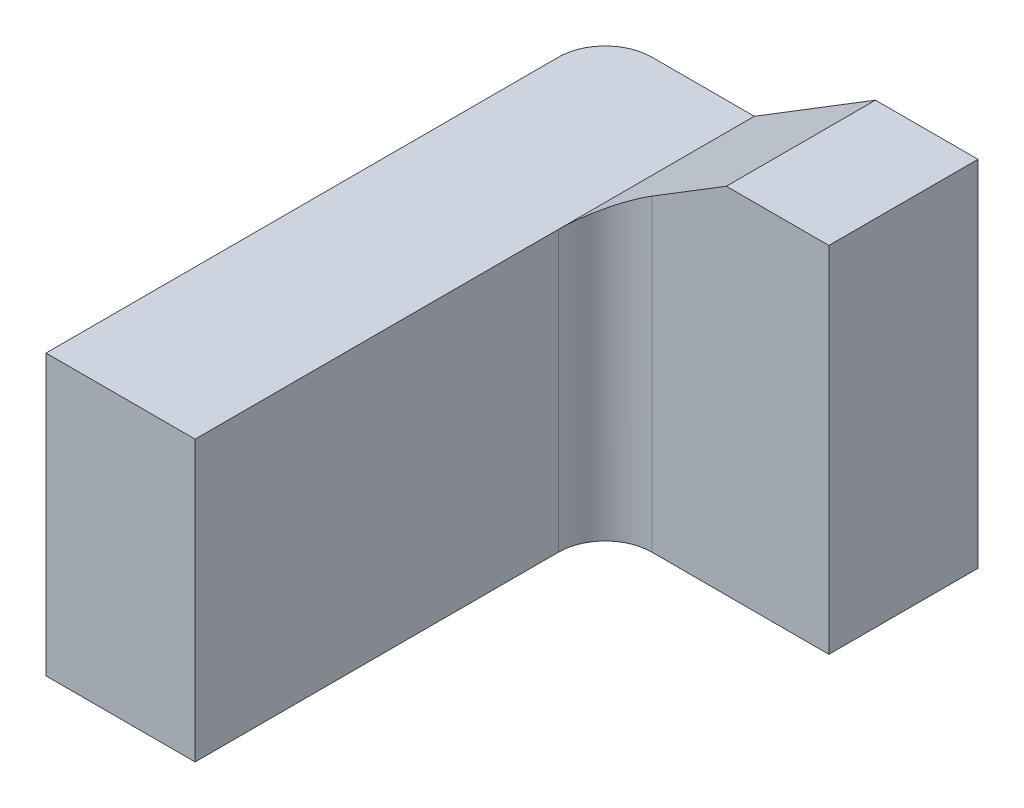
ISO-10303-21;
HEADER;
FILE_DESCRIPTION(('STEP AP214'),'2;1');
FILE_NAME('part.step','',(''),(''),'','','');
FILE_SCHEMA(('AUTOMOTIVE_DESIGN { 1 0 10303 214 1 1 1 1 }'));
ENDSEC;
DATA;
#1=APPLICATION_CONTEXT('core data for automotive mechanical design processes');
#2=APPLICATION_PROTOCOL_DEFINITION('international standard','automotive_design',2000,#1);
#3=PRODUCT_CONTEXT('',#1,'mechanical');
#4=PRODUCT('Part','Part','',(#3));
#5=PRODUCT_RELATED_PRODUCT_CATEGORY('part','',(#4));
#6=PRODUCT_DEFINITION_FORMATION('','',#4);
#7=PRODUCT_DEFINITION_CONTEXT('part definition',#1,'design');
#8=PRODUCT_DEFINITION('design','',#6,#7);
#9=PRODUCT_DEFINITION_SHAPE('','',#8);
#10=(LENGTH_UNIT() NAMED_UNIT(*) SI_UNIT(.MILLI.,.METRE.));
#11=(NAMED_UNIT(*) PLANE_ANGLE_UNIT() SI_UNIT($,.RADIAN.));
#12=(NAMED_UNIT(*) SI_UNIT($,.STERADIAN.) SOLID_ANGLE_UNIT());
#13=UNCERTAINTY_MEASURE_WITH_UNIT(LENGTH_MEASURE(1.E-05),#10,'distance_accuracy_value','');
#14=(GEOMETRIC_REPRESENTATION_CONTEXT(3) GLOBAL_UNCERTAINTY_ASSIGNED_CONTEXT((#13)) GLOBAL_UNIT_ASSIGNED_CONTEXT((#10,
#11,#12)) REPRESENTATION_CONTEXT('',''));
#15=CARTESIAN_POINT('',(0.,0.,0.));
#16=DIRECTION('',(0.,0.,1.));
#17=DIRECTION('',(1.,0.,0.));
#18=AXIS2_PLACEMENT_3D('',#15,#16,#17);
#19=CARTESIAN_POINT('',(0.,0.,0.16));
#20=DIRECTION('',(0.,0.,-1.));
#21=DIRECTION('',(-1.,0.,0.));
#22=AXIS2_PLACEMENT_3D('',#19,#20,#21);
#23=PLANE('',#22);
#24=DIRECTION('',(0.851658316704544,0.524097425664335,0.));
#25=VECTOR('',#24,1.);
#26=CARTESIAN_POINT('',(0.16,0.3,0.16));
#27=LINE('',#26,#25);
#28=CARTESIAN_POINT('',(0.21,0.330769230769231,0.16));
#29=VERTEX_POINT('',#28);
#30=CARTESIAN_POINT('',(0.29,0.38,0.16));
#31=VERTEX_POINT('',#30);
#32=EDGE_CURVE('E159',#29,#31,#27,.T.);
#33=ORIENTED_EDGE('',*,*,#32,.F.);
#34=DIRECTION('',(0.,1.,0.));
#35=VECTOR('',#34,1.);
#36=CARTESIAN_POINT('',(0.21,0.,0.16));
#37=LINE('',#36,#35);
#38=CARTESIAN_POINT('',(0.21,0.,0.16));
#39=VERTEX_POINT('',#38);
#40=EDGE_CURVE('E217',#29,#39,#37,.F.);
#41=ORIENTED_EDGE('',*,*,#40,.T.);
#42=DIRECTION('',(1.,0.,0.));
#43=VECTOR('',#42,1.);
#44=CARTESIAN_POINT('',(0.,0.,0.16));
#45=LINE('',#44,#43);
#46=CARTESIAN_POINT('',(0.4,0.,0.16));
#47=VERTEX_POINT('',#46);
#48=EDGE_CURVE('E126',#39,#47,#45,.T.);
#49=ORIENTED_EDGE('',*,*,#48,.T.);
#50=DIRECTION('',(0.,1.,0.));
#51=VECTOR('',#50,1.);
#52=CARTESIAN_POINT('',(0.4,0.,0.16));
#53=LINE('',#52,#51);
#54=CARTESIAN_POINT('',(0.4,0.38,0.16));
#55=VERTEX_POINT('',#54);
#56=EDGE_CURVE('E167',#47,#55,#53,.T.);
#57=ORIENTED_EDGE('',*,*,#56,.T.);
#58=DIRECTION('',(-1.,0.,0.));
#59=VECTOR('',#58,1.);
#60=CARTESIAN_POINT('',(0.4,0.38,0.16));
#61=LINE('',#60,#59);
#62=EDGE_CURVE('E162',#55,#31,#61,.T.);
#63=ORIENTED_EDGE('',*,*,#62,.T.);
#64=EDGE_LOOP('',(#33,#41,#49,#57,#63));
#65=FACE_BOUND('',#64,.T.);
#66=ADVANCED_FACE('F45',(#65),#23,.F.);
#67=CARTESIAN_POINT('',(0.,0.,0.16));
#68=DIRECTION('',(-1.,0.,0.));
#69=DIRECTION('',(0.,0.,1.));
#70=AXIS2_PLACEMENT_3D('',#67,#68,#69);
#71=PLANE('',#70);
#72=DIRECTION('',(0.,0.,-1.));
#73=VECTOR('',#72,1.);
#74=CARTESIAN_POINT('',(0.,0.3,0.16));
#75=LINE('',#74,#73);
#76=CARTESIAN_POINT('',(0.,0.3,0.6));
#77=VERTEX_POINT('',#76);
#78=CARTESIAN_POINT('',(0.,0.3,0.05));
#79=VERTEX_POINT('',#78);
#80=EDGE_CURVE('E114',#77,#79,#75,.T.);
#81=ORIENTED_EDGE('',*,*,#80,.T.);
#82=DIRECTION('',(0.,1.,0.));
#83=VECTOR('',#82,1.);
#84=CARTESIAN_POINT('',(0.,0.,0.05));
#85=LINE('',#84,#83);
#86=CARTESIAN_POINT('',(0.,0.,0.05));
#87=VERTEX_POINT('',#86);
#88=EDGE_CURVE('E207',#79,#87,#85,.F.);
#89=ORIENTED_EDGE('',*,*,#88,.T.);
#90=DIRECTION('',(0.,0.,-1.));
#91=VECTOR('',#90,1.);
#92=CARTESIAN_POINT('',(0.,0.,0.16));
#93=LINE('',#92,#91);
#94=CARTESIAN_POINT('',(0.,0.,0.6));
#95=VERTEX_POINT('',#94);
#96=EDGE_CURVE('E132',#95,#87,#93,.T.);
#97=ORIENTED_EDGE('',*,*,#96,.F.);
#98=DIRECTION('',(0.,-1.,0.));
#99=VECTOR('',#98,1.);
#100=CARTESIAN_POINT('',(0.,0.,0.6));
#101=LINE('',#100,#99);
#102=EDGE_CURVE('E129',#77,#95,#101,.T.);
#103=ORIENTED_EDGE('',*,*,#102,.F.);
#104=EDGE_LOOP('',(#81,#89,#97,#103));
#105=FACE_BOUND('',#104,.T.);
#106=ADVANCED_FACE('F130',(#105),#71,.T.);
#107=CARTESIAN_POINT('',(0.,0.,0.16));
#108=DIRECTION('',(0.,1.,0.));
#109=DIRECTION('',(0.,0.,1.));
#110=AXIS2_PLACEMENT_3D('',#107,#108,#109);
#111=PLANE('',#110);
#112=ORIENTED_EDGE('',*,*,#96,.T.);
#113=CARTESIAN_POINT('',(0.05,0.,0.05));
#114=DIRECTION('',(0.,1.,0.));
#115=DIRECTION('',(0.,0.,1.));
#116=AXIS2_PLACEMENT_3D('',#113,#114,#115);
#117=CIRCLE('',#116,0.05);
#118=CARTESIAN_POINT('',(0.05,0.,0.));
#119=VERTEX_POINT('',#118);
#120=EDGE_CURVE('E210',#87,#119,#117,.F.);
#121=ORIENTED_EDGE('',*,*,#120,.T.);
#122=DIRECTION('',(1.,0.,0.));
#123=VECTOR('',#122,1.);
#124=CARTESIAN_POINT('',(0.,0.,0.));
#125=LINE('',#124,#123);
#126=CARTESIAN_POINT('',(0.4,0.,0.));
#127=VERTEX_POINT('',#126);
#128=EDGE_CURVE('E163',#119,#127,#125,.T.);
#129=ORIENTED_EDGE('',*,*,#128,.T.);
#130=DIRECTION('',(0.,0.,-1.));
#131=VECTOR('',#130,1.);
#132=CARTESIAN_POINT('',(0.4,0.,0.16));
#133=LINE('',#132,#131);
#134=EDGE_CURVE('E189',#47,#127,#133,.T.);
#135=ORIENTED_EDGE('',*,*,#134,.F.);
#136=ORIENTED_EDGE('',*,*,#48,.F.);
#137=CARTESIAN_POINT('',(0.21,0.,0.21));
#138=DIRECTION('',(0.,1.,0.));
#139=DIRECTION('',(0.,0.,1.));
#140=AXIS2_PLACEMENT_3D('',#137,#138,#139);
#141=CIRCLE('',#140,0.05);
#142=CARTESIAN_POINT('',(0.16,0.,0.21));
#143=VERTEX_POINT('',#142);
#144=EDGE_CURVE('E11',#39,#143,#141,.T.);
#145=ORIENTED_EDGE('',*,*,#144,.T.);
#146=DIRECTION('',(0.,0.,-1.));
#147=VECTOR('',#146,1.);
#148=CARTESIAN_POINT('',(0.16,0.,0.6));
#149=LINE('',#148,#147);
#150=CARTESIAN_POINT('',(0.16,0.,0.6));
#151=VERTEX_POINT('',#150);
#152=EDGE_CURVE('E154',#151,#143,#149,.T.);
#153=ORIENTED_EDGE('',*,*,#152,.F.);
#154=DIRECTION('',(1.,0.,0.));
#155=VECTOR('',#154,1.);
#156=CARTESIAN_POINT('',(0.16,0.,0.6));
#157=LINE('',#156,#155);
#158=EDGE_CURVE('E136',#95,#151,#157,.T.);
#159=ORIENTED_EDGE('',*,*,#158,.F.);
#160=EDGE_LOOP('',(#112,#121,#129,#135,#136,#145,#153,#159));
#161=FACE_BOUND('',#160,.T.);
#162=ADVANCED_FACE('F227',(#161),#111,.F.);
#163=CARTESIAN_POINT('',(0.4,0.,0.16));
#164=DIRECTION('',(-1.,0.,0.));
#165=DIRECTION('',(0.,0.,1.));
#166=AXIS2_PLACEMENT_3D('',#163,#164,#165);
#167=PLANE('',#166);
#168=DIRECTION('',(0.,1.,0.));
#169=VECTOR('',#168,1.);
#170=CARTESIAN_POINT('',(0.4,0.,0.));
#171=LINE('',#170,#169);
#172=CARTESIAN_POINT('',(0.4,0.38,0.));
#173=VERTEX_POINT('',#172);
#174=EDGE_CURVE('E182',#127,#173,#171,.T.);
#175=ORIENTED_EDGE('',*,*,#174,.T.);
#176=DIRECTION('',(0.,0.,-1.));
#177=VECTOR('',#176,1.);
#178=CARTESIAN_POINT('',(0.4,0.38,0.16));
#179=LINE('',#178,#177);
#180=EDGE_CURVE('E193',#55,#173,#179,.T.);
#181=ORIENTED_EDGE('',*,*,#180,.F.);
#182=ORIENTED_EDGE('',*,*,#56,.F.);
#183=ORIENTED_EDGE('',*,*,#134,.T.);
#184=EDGE_LOOP('',(#175,#181,#182,#183));
#185=FACE_BOUND('',#184,.T.);
#186=ADVANCED_FACE('F246',(#185),#167,.F.);
#187=CARTESIAN_POINT('',(0.4,0.38,0.16));
#188=DIRECTION('',(0.,-1.,0.));
#189=DIRECTION('',(0.,0.,-1.));
#190=AXIS2_PLACEMENT_3D('',#187,#188,#189);
#191=PLANE('',#190);
#192=DIRECTION('',(-1.,0.,0.));
#193=VECTOR('',#192,1.);
#194=CARTESIAN_POINT('',(0.4,0.38,0.));
#195=LINE('',#194,#193);
#196=CARTESIAN_POINT('',(0.29,0.38,0.));
#197=VERTEX_POINT('',#196);
#198=EDGE_CURVE('E178',#173,#197,#195,.T.);
#199=ORIENTED_EDGE('',*,*,#198,.T.);
#200=DIRECTION('',(0.,0.,-1.));
#201=VECTOR('',#200,1.);
#202=CARTESIAN_POINT('',(0.29,0.38,0.16));
#203=LINE('',#202,#201);
#204=EDGE_CURVE('E196',#31,#197,#203,.T.);
#205=ORIENTED_EDGE('',*,*,#204,.F.);
#206=ORIENTED_EDGE('',*,*,#62,.F.);
#207=ORIENTED_EDGE('',*,*,#180,.T.);
#208=EDGE_LOOP('',(#199,#205,#206,#207));
#209=FACE_BOUND('',#208,.T.);
#210=ADVANCED_FACE('F250',(#209),#191,.F.);
#211=CARTESIAN_POINT('',(0.16,0.3,0.16));
#212=DIRECTION('',(-0.524097425664335,0.851658316704544,0.));
#213=DIRECTION('',(-0.851658316704544,-0.524097425664335,0.));
#214=AXIS2_PLACEMENT_3D('',#211,#212,#213);
#215=PLANE('',#214);
#216=DIRECTION('',(0.851658316704544,0.524097425664335,0.));
#217=VECTOR('',#216,1.);
#218=CARTESIAN_POINT('',(0.16,0.3,0.));
#219=LINE('',#218,#217);
#220=CARTESIAN_POINT('',(0.16,0.3,0.));
#221=VERTEX_POINT('',#220);
#222=EDGE_CURVE('E174',#221,#197,#219,.T.);
#223=ORIENTED_EDGE('',*,*,#222,.F.);
#224=DIRECTION('',(0.,0.,-1.));
#225=VECTOR('',#224,1.);
#226=CARTESIAN_POINT('',(0.16,0.3,0.16));
#227=LINE('',#226,#225);
#228=CARTESIAN_POINT('',(0.16,0.3,0.21));
#229=VERTEX_POINT('',#228);
#230=EDGE_CURVE('E125',#229,#221,#227,.T.);
#231=ORIENTED_EDGE('',*,*,#230,.F.);
#232=CARTESIAN_POINT('',(0.21,0.330769230769231,0.21));
#233=DIRECTION('',(-0.524097425664335,0.851658316704544,0.));
#234=DIRECTION('',(-0.851658316704544,-0.524097425664335,0.));
#235=AXIS2_PLACEMENT_3D('',#232,#233,#234);
#236=ELLIPSE('',#235,0.0587089904710529,0.05);
#237=EDGE_CURVE('E55',#229,#29,#236,.F.);
#238=ORIENTED_EDGE('',*,*,#237,.T.);
#239=ORIENTED_EDGE('',*,*,#32,.T.);
#240=ORIENTED_EDGE('',*,*,#204,.T.);
#241=EDGE_LOOP('',(#223,#231,#238,#239,#240));
#242=FACE_BOUND('',#241,.T.);
#243=ADVANCED_FACE('F234',(#242),#215,.T.);
#244=CARTESIAN_POINT('',(0.,0.3,0.16));
#245=DIRECTION('',(0.,1.,0.));
#246=DIRECTION('',(0.,0.,1.));
#247=AXIS2_PLACEMENT_3D('',#244,#245,#246);
#248=PLANE('',#247);
#249=DIRECTION('',(1.,0.,0.));
#250=VECTOR('',#249,1.);
#251=CARTESIAN_POINT('',(0.,0.3,0.));
#252=LINE('',#251,#250);
#253=CARTESIAN_POINT('',(0.05,0.3,0.));
#254=VERTEX_POINT('',#253);
#255=EDGE_CURVE('E158',#254,#221,#252,.T.);
#256=ORIENTED_EDGE('',*,*,#255,.F.);
#257=CARTESIAN_POINT('',(0.05,0.3,0.05));
#258=DIRECTION('',(0.,1.,0.));
#259=DIRECTION('',(0.,0.,1.));
#260=AXIS2_PLACEMENT_3D('',#257,#258,#259);
#261=CIRCLE('',#260,0.05);
#262=EDGE_CURVE('E121',#254,#79,#261,.T.);
#263=ORIENTED_EDGE('',*,*,#262,.T.);
#264=ORIENTED_EDGE('',*,*,#80,.F.);
#265=DIRECTION('',(-1.,0.,0.));
#266=VECTOR('',#265,1.);
#267=CARTESIAN_POINT('',(0.16,0.3,0.6));
#268=LINE('',#267,#266);
#269=CARTESIAN_POINT('',(0.16,0.3,0.6));
#270=VERTEX_POINT('',#269);
#271=EDGE_CURVE('E120',#270,#77,#268,.T.);
#272=ORIENTED_EDGE('',*,*,#271,.F.);
#273=DIRECTION('',(0.,0.,-1.));
#274=VECTOR('',#273,1.);
#275=CARTESIAN_POINT('',(0.16,0.3,0.6));
#276=LINE('',#275,#274);
#277=EDGE_CURVE('E151',#270,#229,#276,.T.);
#278=ORIENTED_EDGE('',*,*,#277,.T.);
#279=ORIENTED_EDGE('',*,*,#230,.T.);
#280=EDGE_LOOP('',(#256,#263,#264,#272,#278,#279));
#281=FACE_BOUND('',#280,.T.);
#282=ADVANCED_FACE('F117',(#281),#248,.T.);
#283=CARTESIAN_POINT('',(0.,0.,0.));
#284=DIRECTION('',(0.,0.,-1.));
#285=DIRECTION('',(-1.,0.,0.));
#286=AXIS2_PLACEMENT_3D('',#283,#284,#285);
#287=PLANE('',#286);
#288=ORIENTED_EDGE('',*,*,#128,.F.);
#289=DIRECTION('',(0.,1.,0.));
#290=VECTOR('',#289,1.);
#291=CARTESIAN_POINT('',(0.05,0.,0.));
#292=LINE('',#291,#290);
#293=EDGE_CURVE('E188',#119,#254,#292,.T.);
#294=ORIENTED_EDGE('',*,*,#293,.T.);
#295=ORIENTED_EDGE('',*,*,#255,.T.);
#296=ORIENTED_EDGE('',*,*,#222,.T.);
#297=ORIENTED_EDGE('',*,*,#198,.F.);
#298=ORIENTED_EDGE('',*,*,#174,.F.);
#299=EDGE_LOOP('',(#288,#294,#295,#296,#297,#298));
#300=FACE_BOUND('',#299,.T.);
#301=ADVANCED_FACE('F239',(#300),#287,.T.);
#302=CARTESIAN_POINT('',(0.16,0.,0.6));
#303=DIRECTION('',(-1.,0.,0.));
#304=DIRECTION('',(0.,-1.,0.));
#305=AXIS2_PLACEMENT_3D('',#302,#303,#304);
#306=PLANE('',#305);
#307=ORIENTED_EDGE('',*,*,#152,.T.);
#308=DIRECTION('',(0.,1.,0.));
#309=VECTOR('',#308,1.);
#310=CARTESIAN_POINT('',(0.16,0.3,0.21));
#311=LINE('',#310,#309);
#312=EDGE_CURVE('E213',#143,#229,#311,.T.);
#313=ORIENTED_EDGE('',*,*,#312,.T.);
#314=ORIENTED_EDGE('',*,*,#277,.F.);
#315=DIRECTION('',(0.,1.,0.));
#316=VECTOR('',#315,1.);
#317=CARTESIAN_POINT('',(0.16,0.,0.6));
#318=LINE('',#317,#316);
#319=EDGE_CURVE('E140',#151,#270,#318,.T.);
#320=ORIENTED_EDGE('',*,*,#319,.F.);
#321=EDGE_LOOP('',(#307,#313,#314,#320));
#322=FACE_BOUND('',#321,.T.);
#323=ADVANCED_FACE('F232',(#322),#306,.F.);
#324=CARTESIAN_POINT('',(0.,0.,0.6));
#325=DIRECTION('',(0.,0.,-1.));
#326=DIRECTION('',(-1.,0.,0.));
#327=AXIS2_PLACEMENT_3D('',#324,#325,#326);
#328=PLANE('',#327);
#329=ORIENTED_EDGE('',*,*,#271,.T.);
#330=ORIENTED_EDGE('',*,*,#102,.T.);
#331=ORIENTED_EDGE('',*,*,#158,.T.);
#332=ORIENTED_EDGE('',*,*,#319,.T.);
#333=EDGE_LOOP('',(#329,#330,#331,#332));
#334=FACE_BOUND('',#333,.T.);
#335=ADVANCED_FACE('F138',(#334),#328,.F.);
#336=CARTESIAN_POINT('',(0.05,0.,0.05));
#337=DIRECTION('',(0.,1.,0.));
#338=DIRECTION('',(0.,0.,1.));
#339=AXIS2_PLACEMENT_3D('',#336,#337,#338);
#340=CYLINDRICAL_SURFACE('',#339,0.05);
#341=ORIENTED_EDGE('',*,*,#120,.F.);
#342=ORIENTED_EDGE('',*,*,#88,.F.);
#343=ORIENTED_EDGE('',*,*,#262,.F.);
#344=ORIENTED_EDGE('',*,*,#293,.F.);
#345=EDGE_LOOP('',(#341,#342,#343,#344));
#346=FACE_BOUND('',#345,.T.);
#347=ADVANCED_FACE('F244',(#346),#340,.T.);
#348=CARTESIAN_POINT('',(0.21,0.,0.21));
#349=DIRECTION('',(0.,-1.,0.));
#350=DIRECTION('',(1.,0.,0.));
#351=AXIS2_PLACEMENT_3D('',#348,#349,#350);
#352=CYLINDRICAL_SURFACE('',#351,0.05);
#353=ORIENTED_EDGE('',*,*,#144,.F.);
#354=ORIENTED_EDGE('',*,*,#40,.F.);
#355=ORIENTED_EDGE('',*,*,#237,.F.);
#356=ORIENTED_EDGE('',*,*,#312,.F.);
#357=EDGE_LOOP('',(#353,#354,#355,#356));
#358=FACE_BOUND('',#357,.T.);
#359=ADVANCED_FACE('F47',(#358),#352,.F.);
#360=CLOSED_SHELL('',(#66,#106,#162,#186,#210,#243,#282,#301,#323,#335,#347,#359));
#361=MANIFOLD_SOLID_BREP('B2',#360);
#362=ADVANCED_BREP_SHAPE_REPRESENTATION('',(#18,#361),#14);
#363=SHAPE_DEFINITION_REPRESENTATION(#9,#362);
ENDSEC;
END-ISO-10303-21;
